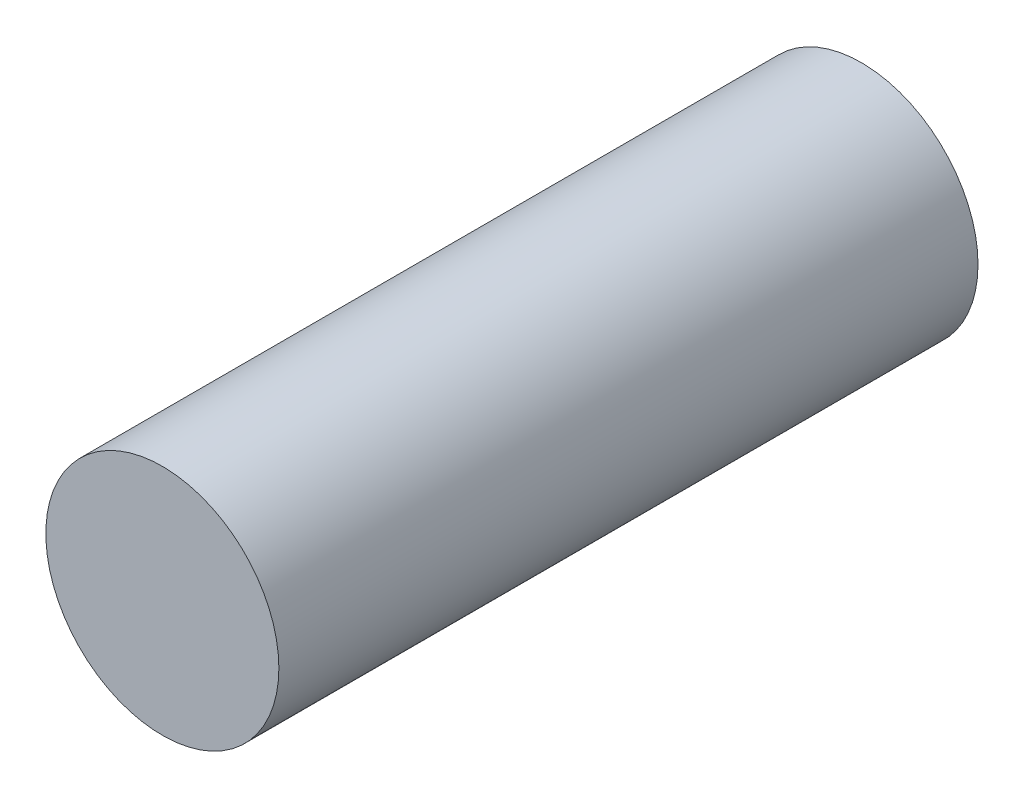
ISO-10303-21;
HEADER;
FILE_DESCRIPTION(('STEP AP214'),'2;1');
FILE_NAME('part.step','',(''),(''),'','','');
FILE_SCHEMA(('AUTOMOTIVE_DESIGN { 1 0 10303 214 1 1 1 1 }'));
ENDSEC;
DATA;
#1=APPLICATION_CONTEXT('core data for automotive mechanical design processes');
#2=APPLICATION_PROTOCOL_DEFINITION('international standard','automotive_design',2000,#1);
#3=PRODUCT_CONTEXT('',#1,'mechanical');
#4=PRODUCT('Part','Part','',(#3));
#5=PRODUCT_RELATED_PRODUCT_CATEGORY('part','',(#4));
#6=PRODUCT_DEFINITION_FORMATION('','',#4);
#7=PRODUCT_DEFINITION_CONTEXT('part definition',#1,'design');
#8=PRODUCT_DEFINITION('design','',#6,#7);
#9=PRODUCT_DEFINITION_SHAPE('','',#8);
#10=(LENGTH_UNIT() NAMED_UNIT(*) SI_UNIT(.MILLI.,.METRE.));
#11=(NAMED_UNIT(*) PLANE_ANGLE_UNIT() SI_UNIT($,.RADIAN.));
#12=(NAMED_UNIT(*) SI_UNIT($,.STERADIAN.) SOLID_ANGLE_UNIT());
#13=UNCERTAINTY_MEASURE_WITH_UNIT(LENGTH_MEASURE(1.E-05),#10,'distance_accuracy_value','');
#14=(GEOMETRIC_REPRESENTATION_CONTEXT(3) GLOBAL_UNCERTAINTY_ASSIGNED_CONTEXT((#13)) GLOBAL_UNIT_ASSIGNED_CONTEXT((#10,
#11,#12)) REPRESENTATION_CONTEXT('',''));
#15=CARTESIAN_POINT('',(0.,0.,0.));
#16=DIRECTION('',(0.,0.,1.));
#17=DIRECTION('',(1.,0.,0.));
#18=AXIS2_PLACEMENT_3D('',#15,#16,#17);
#19=CARTESIAN_POINT('',(0.,0.,30.));
#20=DIRECTION('',(0.,0.,-1.));
#21=DIRECTION('',(-1.,0.,0.));
#22=AXIS2_PLACEMENT_3D('',#19,#20,#21);
#23=CYLINDRICAL_SURFACE('',#22,5.);
#24=CARTESIAN_POINT('',(0.,0.,30.));
#25=DIRECTION('',(0.,0.,1.));
#26=DIRECTION('',(1.,0.,0.));
#27=AXIS2_PLACEMENT_3D('',#24,#25,#26);
#28=CIRCLE('',#27,5.);
#29=CARTESIAN_POINT('',(5.,0.,30.));
#30=VERTEX_POINT('',#29);
#31=EDGE_CURVE('E10',#30,#30,#28,.T.);
#32=ORIENTED_EDGE('',*,*,#31,.F.);
#33=EDGE_LOOP('',(#32));
#34=FACE_BOUND('',#33,.T.);
#35=CARTESIAN_POINT('',(0.,0.,0.));
#36=DIRECTION('',(0.,0.,1.));
#37=DIRECTION('',(1.,0.,0.));
#38=AXIS2_PLACEMENT_3D('',#35,#36,#37);
#39=CIRCLE('',#38,5.);
#40=CARTESIAN_POINT('',(5.,0.,0.));
#41=VERTEX_POINT('',#40);
#42=EDGE_CURVE('E36',#41,#41,#39,.T.);
#43=ORIENTED_EDGE('',*,*,#42,.T.);
#44=EDGE_LOOP('',(#43));
#45=FACE_BOUND('',#44,.T.);
#46=ADVANCED_FACE('F33',(#34,#45),#23,.T.);
#47=CARTESIAN_POINT('',(0.,0.,30.));
#48=DIRECTION('',(0.,0.,1.));
#49=DIRECTION('',(1.,0.,0.));
#50=AXIS2_PLACEMENT_3D('',#47,#48,#49);
#51=PLANE('',#50);
#52=ORIENTED_EDGE('',*,*,#31,.T.);
#53=EDGE_LOOP('',(#52));
#54=FACE_BOUND('',#53,.T.);
#55=ADVANCED_FACE('F48',(#54),#51,.T.);
#56=CARTESIAN_POINT('',(0.,0.,0.));
#57=DIRECTION('',(0.,0.,1.));
#58=DIRECTION('',(1.,0.,0.));
#59=AXIS2_PLACEMENT_3D('',#56,#57,#58);
#60=PLANE('',#59);
#61=ORIENTED_EDGE('',*,*,#42,.F.);
#62=EDGE_LOOP('',(#61));
#63=FACE_BOUND('',#62,.T.);
#64=ADVANCED_FACE('F46',(#63),#60,.F.);
#65=CLOSED_SHELL('',(#46,#55,#64));
#66=MANIFOLD_SOLID_BREP('B2',#65);
#67=ADVANCED_BREP_SHAPE_REPRESENTATION('',(#18,#66),#14);
#68=SHAPE_DEFINITION_REPRESENTATION(#9,#67);
ENDSEC;
END-ISO-10303-21;
